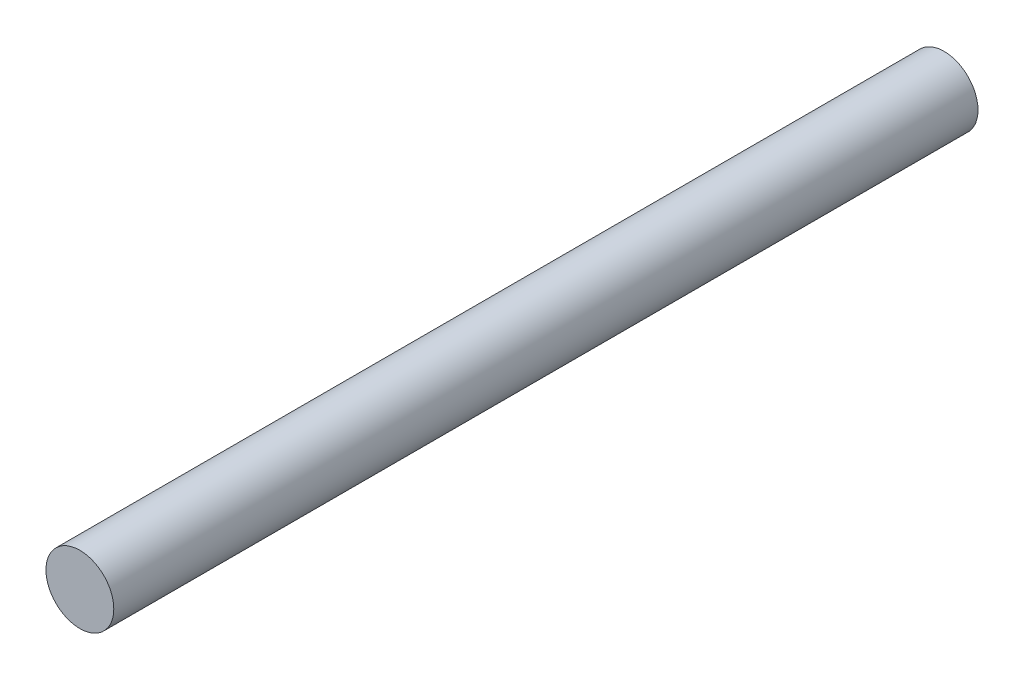
ISO-10303-21;
HEADER;
FILE_DESCRIPTION(('STEP AP214'),'2;1');
FILE_NAME('part.step','',(''),(''),'','','');
FILE_SCHEMA(('AUTOMOTIVE_DESIGN { 1 0 10303 214 1 1 1 1 }'));
ENDSEC;
DATA;
#1=APPLICATION_CONTEXT('core data for automotive mechanical design processes');
#2=APPLICATION_PROTOCOL_DEFINITION('international standard','automotive_design',2000,#1);
#3=PRODUCT_CONTEXT('',#1,'mechanical');
#4=PRODUCT('Part','Part','',(#3));
#5=PRODUCT_RELATED_PRODUCT_CATEGORY('part','',(#4));
#6=PRODUCT_DEFINITION_FORMATION('','',#4);
#7=PRODUCT_DEFINITION_CONTEXT('part definition',#1,'design');
#8=PRODUCT_DEFINITION('design','',#6,#7);
#9=PRODUCT_DEFINITION_SHAPE('','',#8);
#10=(LENGTH_UNIT() NAMED_UNIT(*) SI_UNIT(.MILLI.,.METRE.));
#11=(NAMED_UNIT(*) PLANE_ANGLE_UNIT() SI_UNIT($,.RADIAN.));
#12=(NAMED_UNIT(*) SI_UNIT($,.STERADIAN.) SOLID_ANGLE_UNIT());
#13=UNCERTAINTY_MEASURE_WITH_UNIT(LENGTH_MEASURE(1.E-05),#10,'distance_accuracy_value','');
#14=(GEOMETRIC_REPRESENTATION_CONTEXT(3) GLOBAL_UNCERTAINTY_ASSIGNED_CONTEXT((#13)) GLOBAL_UNIT_ASSIGNED_CONTEXT((#10,
#11,#12)) REPRESENTATION_CONTEXT('',''));
#15=CARTESIAN_POINT('',(0.,0.,0.));
#16=DIRECTION('',(0.,0.,1.));
#17=DIRECTION('',(1.,0.,0.));
#18=AXIS2_PLACEMENT_3D('',#15,#16,#17);
#19=CARTESIAN_POINT('',(0.,0.,19.105));
#20=DIRECTION('',(0.,0.,-1.));
#21=DIRECTION('',(-1.,0.,0.));
#22=AXIS2_PLACEMENT_3D('',#19,#20,#21);
#23=CYLINDRICAL_SURFACE('',#22,1.5);
#24=CARTESIAN_POINT('',(0.,0.,19.105));
#25=DIRECTION('',(0.,0.,1.));
#26=DIRECTION('',(1.,0.,0.));
#27=AXIS2_PLACEMENT_3D('',#24,#25,#26);
#28=CIRCLE('',#27,1.5);
#29=CARTESIAN_POINT('',(1.5,0.,19.105));
#30=VERTEX_POINT('',#29);
#31=EDGE_CURVE('E10',#30,#30,#28,.T.);
#32=ORIENTED_EDGE('',*,*,#31,.F.);
#33=EDGE_LOOP('',(#32));
#34=FACE_BOUND('',#33,.T.);
#35=CARTESIAN_POINT('',(0.,0.,-19.105));
#36=DIRECTION('',(0.,0.,1.));
#37=DIRECTION('',(1.,0.,0.));
#38=AXIS2_PLACEMENT_3D('',#35,#36,#37);
#39=CIRCLE('',#38,1.5);
#40=CARTESIAN_POINT('',(1.5,0.,-19.105));
#41=VERTEX_POINT('',#40);
#42=EDGE_CURVE('E17',#41,#41,#39,.T.);
#43=ORIENTED_EDGE('',*,*,#42,.T.);
#44=EDGE_LOOP('',(#43));
#45=FACE_BOUND('',#44,.T.);
#46=ADVANCED_FACE('F14',(#34,#45),#23,.T.);
#47=CARTESIAN_POINT('',(0.,0.,19.105));
#48=DIRECTION('',(0.,0.,1.));
#49=DIRECTION('',(1.,0.,0.));
#50=AXIS2_PLACEMENT_3D('',#47,#48,#49);
#51=PLANE('',#50);
#52=ORIENTED_EDGE('',*,*,#31,.T.);
#53=EDGE_LOOP('',(#52));
#54=FACE_BOUND('',#53,.T.);
#55=ADVANCED_FACE('F29',(#54),#51,.T.);
#56=CARTESIAN_POINT('',(0.,0.,-19.105));
#57=DIRECTION('',(0.,0.,1.));
#58=DIRECTION('',(1.,0.,0.));
#59=AXIS2_PLACEMENT_3D('',#56,#57,#58);
#60=PLANE('',#59);
#61=ORIENTED_EDGE('',*,*,#42,.F.);
#62=EDGE_LOOP('',(#61));
#63=FACE_BOUND('',#62,.T.);
#64=ADVANCED_FACE('F27',(#63),#60,.F.);
#65=CLOSED_SHELL('',(#46,#55,#64));
#66=MANIFOLD_SOLID_BREP('B1',#65);
#67=ADVANCED_BREP_SHAPE_REPRESENTATION('',(#18,#66),#14);
#68=SHAPE_DEFINITION_REPRESENTATION(#9,#67);
ENDSEC;
END-ISO-10303-21;
